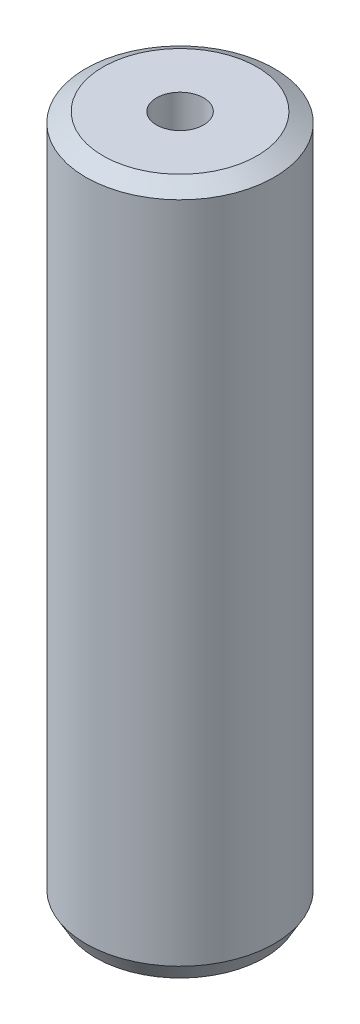
ISO-10303-21;
HEADER;
FILE_DESCRIPTION(('STEP AP214'),'2;1');
FILE_NAME('part.step','',(''),(''),'','','');
FILE_SCHEMA(('AUTOMOTIVE_DESIGN { 1 0 10303 214 1 1 1 1 }'));
ENDSEC;
DATA;
#1=APPLICATION_CONTEXT('core data for automotive mechanical design processes');
#2=APPLICATION_PROTOCOL_DEFINITION('international standard','automotive_design',2000,#1);
#3=PRODUCT_CONTEXT('',#1,'mechanical');
#4=PRODUCT('Part','Part','',(#3));
#5=PRODUCT_RELATED_PRODUCT_CATEGORY('part','',(#4));
#6=PRODUCT_DEFINITION_FORMATION('','',#4);
#7=PRODUCT_DEFINITION_CONTEXT('part definition',#1,'design');
#8=PRODUCT_DEFINITION('design','',#6,#7);
#9=PRODUCT_DEFINITION_SHAPE('','',#8);
#10=(LENGTH_UNIT() NAMED_UNIT(*) SI_UNIT(.MILLI.,.METRE.));
#11=(NAMED_UNIT(*) PLANE_ANGLE_UNIT() SI_UNIT($,.RADIAN.));
#12=(NAMED_UNIT(*) SI_UNIT($,.STERADIAN.) SOLID_ANGLE_UNIT());
#13=UNCERTAINTY_MEASURE_WITH_UNIT(LENGTH_MEASURE(1.E-05),#10,'distance_accuracy_value','');
#14=(GEOMETRIC_REPRESENTATION_CONTEXT(3) GLOBAL_UNCERTAINTY_ASSIGNED_CONTEXT((#13)) GLOBAL_UNIT_ASSIGNED_CONTEXT((#10,
#11,#12)) REPRESENTATION_CONTEXT('',''));
#15=CARTESIAN_POINT('',(0.,0.,0.));
#16=DIRECTION('',(0.,0.,1.));
#17=DIRECTION('',(1.,0.,0.));
#18=AXIS2_PLACEMENT_3D('',#15,#16,#17);
#19=CARTESIAN_POINT('',(0.,73.3156384979971,0.));
#20=DIRECTION('',(0.,-1.,0.));
#21=DIRECTION('',(0.,0.,-1.));
#22=AXIS2_PLACEMENT_3D('',#19,#20,#21);
#23=CYLINDRICAL_SURFACE('',#22,10.);
#24=CARTESIAN_POINT('',(0.,72.2609321143897,0.));
#25=DIRECTION('',(0.,1.,0.));
#26=DIRECTION('',(0.,0.,1.));
#27=AXIS2_PLACEMENT_3D('',#24,#25,#26);
#28=CIRCLE('',#27,10.);
#29=CARTESIAN_POINT('',(0.,72.2609321143897,10.));
#30=VERTEX_POINT('',#29);
#31=EDGE_CURVE('E50',#30,#30,#28,.F.);
#32=ORIENTED_EDGE('',*,*,#31,.T.);
#33=EDGE_LOOP('',(#32));
#34=FACE_BOUND('',#33,.T.);
#35=CARTESIAN_POINT('',(0.,1.82680504347521,0.));
#36=DIRECTION('',(0.,1.,0.));
#37=DIRECTION('',(0.,0.,1.));
#38=AXIS2_PLACEMENT_3D('',#35,#36,#37);
#39=CIRCLE('',#38,10.);
#40=CARTESIAN_POINT('',(0.,1.82680504347521,10.));
#41=VERTEX_POINT('',#40);
#42=EDGE_CURVE('E51',#41,#41,#39,.T.);
#43=ORIENTED_EDGE('',*,*,#42,.T.);
#44=EDGE_LOOP('',(#43));
#45=FACE_BOUND('',#44,.T.);
#46=ADVANCED_FACE('F39',(#34,#45),#23,.T.);
#47=CARTESIAN_POINT('',(0.,73.3156384979971,0.));
#48=DIRECTION('',(0.,1.,0.));
#49=DIRECTION('',(0.,0.,1.));
#50=AXIS2_PLACEMENT_3D('',#47,#48,#49);
#51=PLANE('',#50);
#52=CARTESIAN_POINT('',(0.,73.3156384979971,0.));
#53=DIRECTION('',(0.,1.,0.));
#54=DIRECTION('',(0.,0.,1.));
#55=AXIS2_PLACEMENT_3D('',#52,#53,#54);
#56=CIRCLE('',#55,8.17319495652474);
#57=CARTESIAN_POINT('',(0.,73.3156384979971,8.17319495652474));
#58=VERTEX_POINT('',#57);
#59=EDGE_CURVE('E54',#58,#58,#56,.T.);
#60=ORIENTED_EDGE('',*,*,#59,.T.);
#61=EDGE_LOOP('',(#60));
#62=FACE_BOUND('',#61,.T.);
#63=CARTESIAN_POINT('',(0.,73.3156384979971,0.));
#64=DIRECTION('',(0.,1.,0.));
#65=DIRECTION('',(0.,0.,1.));
#66=AXIS2_PLACEMENT_3D('',#63,#64,#65);
#67=CIRCLE('',#66,2.49845777221963);
#68=CARTESIAN_POINT('',(0.,73.3156384979971,2.49845777221963));
#69=VERTEX_POINT('',#68);
#70=EDGE_CURVE('E58',#69,#69,#67,.T.);
#71=ORIENTED_EDGE('',*,*,#70,.F.);
#72=EDGE_LOOP('',(#71));
#73=FACE_BOUND('',#72,.T.);
#74=ADVANCED_FACE('F69',(#62,#73),#51,.T.);
#75=CARTESIAN_POINT('',(0.,0.,0.));
#76=DIRECTION('',(0.,1.,0.));
#77=DIRECTION('',(0.,0.,1.));
#78=AXIS2_PLACEMENT_3D('',#75,#76,#77);
#79=PLANE('',#78);
#80=CARTESIAN_POINT('',(0.,0.,0.));
#81=DIRECTION('',(0.,1.,0.));
#82=DIRECTION('',(0.,0.,1.));
#83=AXIS2_PLACEMENT_3D('',#80,#81,#82);
#84=CIRCLE('',#83,8.94529361639261);
#85=CARTESIAN_POINT('',(0.,0.,8.94529361639261));
#86=VERTEX_POINT('',#85);
#87=EDGE_CURVE('E10',#86,#86,#84,.F.);
#88=ORIENTED_EDGE('',*,*,#87,.T.);
#89=EDGE_LOOP('',(#88));
#90=FACE_BOUND('',#89,.T.);
#91=CARTESIAN_POINT('',(0.,0.,0.));
#92=DIRECTION('',(0.,1.,0.));
#93=DIRECTION('',(0.,0.,1.));
#94=AXIS2_PLACEMENT_3D('',#91,#92,#93);
#95=CIRCLE('',#94,2.49845777221963);
#96=CARTESIAN_POINT('',(0.,0.,2.49845777221963));
#97=VERTEX_POINT('',#96);
#98=EDGE_CURVE('E63',#97,#97,#95,.T.);
#99=ORIENTED_EDGE('',*,*,#98,.T.);
#100=EDGE_LOOP('',(#99));
#101=FACE_BOUND('',#100,.T.);
#102=ADVANCED_FACE('F75',(#90,#101),#79,.F.);
#103=CARTESIAN_POINT('',(0.,73.3156384979971,0.));
#104=DIRECTION('',(0.,-1.,0.));
#105=DIRECTION('',(0.,0.,-1.));
#106=AXIS2_PLACEMENT_3D('',#103,#104,#105);
#107=CYLINDRICAL_SURFACE('',#106,2.49845777221963);
#108=ORIENTED_EDGE('',*,*,#70,.T.);
#109=EDGE_LOOP('',(#108));
#110=FACE_BOUND('',#109,.T.);
#111=ORIENTED_EDGE('',*,*,#98,.F.);
#112=EDGE_LOOP('',(#111));
#113=FACE_BOUND('',#112,.T.);
#114=ADVANCED_FACE('F70',(#110,#113),#107,.F.);
#115=CARTESIAN_POINT('',(0.,73.3156384979971,0.));
#116=DIRECTION('',(0.,-1.,0.));
#117=DIRECTION('',(0.,0.,-1.));
#118=AXIS2_PLACEMENT_3D('',#115,#116,#117);
#119=CONICAL_SURFACE('',#118,8.17319495652474,1.0471975511966);
#120=ORIENTED_EDGE('',*,*,#31,.F.);
#121=EDGE_LOOP('',(#120));
#122=FACE_BOUND('',#121,.T.);
#123=ORIENTED_EDGE('',*,*,#59,.F.);
#124=EDGE_LOOP('',(#123));
#125=FACE_BOUND('',#124,.T.);
#126=ADVANCED_FACE('F81',(#122,#125),#119,.T.);
#127=CARTESIAN_POINT('',(0.,1.82680504347521,0.));
#128=DIRECTION('',(0.,1.,0.));
#129=DIRECTION('',(0.,0.,1.));
#130=AXIS2_PLACEMENT_3D('',#127,#128,#129);
#131=CONICAL_SURFACE('',#130,10.,0.523598775598302);
#132=ORIENTED_EDGE('',*,*,#87,.F.);
#133=EDGE_LOOP('',(#132));
#134=FACE_BOUND('',#133,.T.);
#135=ORIENTED_EDGE('',*,*,#42,.F.);
#136=EDGE_LOOP('',(#135));
#137=FACE_BOUND('',#136,.T.);
#138=ADVANCED_FACE('F45',(#134,#137),#131,.T.);
#139=CLOSED_SHELL('',(#46,#74,#102,#114,#126,#138));
#140=MANIFOLD_SOLID_BREP('B2',#139);
#141=ADVANCED_BREP_SHAPE_REPRESENTATION('',(#18,#140),#14);
#142=SHAPE_DEFINITION_REPRESENTATION(#9,#141);
ENDSEC;
END-ISO-10303-21;
